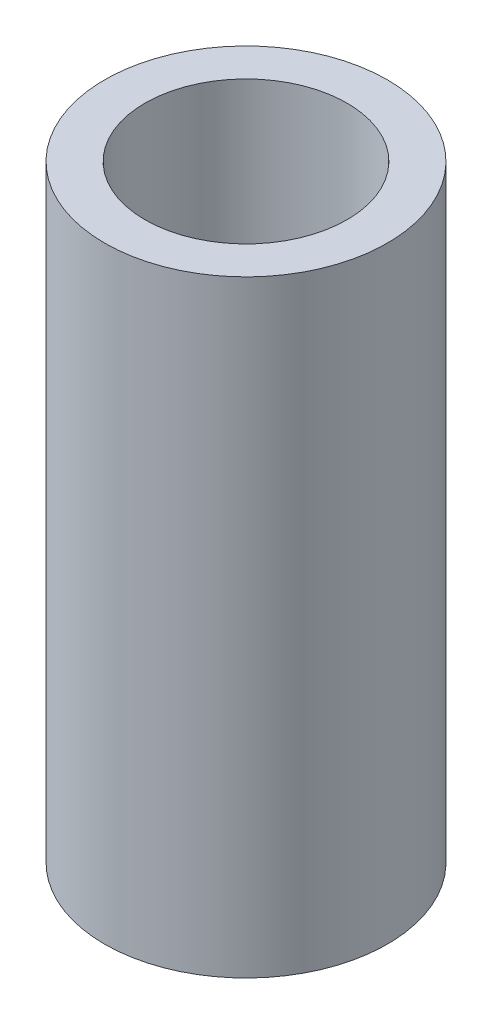
ISO-10303-21;
HEADER;
FILE_DESCRIPTION(('STEP AP214'),'2;1');
FILE_NAME('part.step','',(''),(''),'','','');
FILE_SCHEMA(('AUTOMOTIVE_DESIGN { 1 0 10303 214 1 1 1 1 }'));
ENDSEC;
DATA;
#1=APPLICATION_CONTEXT('core data for automotive mechanical design processes');
#2=APPLICATION_PROTOCOL_DEFINITION('international standard','automotive_design',2000,#1);
#3=PRODUCT_CONTEXT('',#1,'mechanical');
#4=PRODUCT('Part','Part','',(#3));
#5=PRODUCT_RELATED_PRODUCT_CATEGORY('part','',(#4));
#6=PRODUCT_DEFINITION_FORMATION('','',#4);
#7=PRODUCT_DEFINITION_CONTEXT('part definition',#1,'design');
#8=PRODUCT_DEFINITION('design','',#6,#7);
#9=PRODUCT_DEFINITION_SHAPE('','',#8);
#10=(LENGTH_UNIT() NAMED_UNIT(*) SI_UNIT(.MILLI.,.METRE.));
#11=(NAMED_UNIT(*) PLANE_ANGLE_UNIT() SI_UNIT($,.RADIAN.));
#12=(NAMED_UNIT(*) SI_UNIT($,.STERADIAN.) SOLID_ANGLE_UNIT());
#13=UNCERTAINTY_MEASURE_WITH_UNIT(LENGTH_MEASURE(1.E-05),#10,'distance_accuracy_value','');
#14=(GEOMETRIC_REPRESENTATION_CONTEXT(3) GLOBAL_UNCERTAINTY_ASSIGNED_CONTEXT((#13)) GLOBAL_UNIT_ASSIGNED_CONTEXT((#10,
#11,#12)) REPRESENTATION_CONTEXT('',''));
#15=CARTESIAN_POINT('',(0.,0.,0.));
#16=DIRECTION('',(0.,0.,1.));
#17=DIRECTION('',(1.,0.,0.));
#18=AXIS2_PLACEMENT_3D('',#15,#16,#17);
#19=CARTESIAN_POINT('',(0.,75.139010184047,0.));
#20=DIRECTION('',(0.,-1.,0.));
#21=DIRECTION('',(0.,0.,-1.));
#22=AXIS2_PLACEMENT_3D('',#19,#20,#21);
#23=CYLINDRICAL_SURFACE('',#22,17.5);
#24=CARTESIAN_POINT('',(0.,75.139010184047,0.));
#25=DIRECTION('',(0.,1.,0.));
#26=DIRECTION('',(0.,0.,1.));
#27=AXIS2_PLACEMENT_3D('',#24,#25,#26);
#28=CIRCLE('',#27,17.5);
#29=CARTESIAN_POINT('',(0.,75.139010184047,17.5));
#30=VERTEX_POINT('',#29);
#31=EDGE_CURVE('E10',#30,#30,#28,.T.);
#32=ORIENTED_EDGE('',*,*,#31,.F.);
#33=EDGE_LOOP('',(#32));
#34=FACE_BOUND('',#33,.T.);
#35=CARTESIAN_POINT('',(0.,0.,0.));
#36=DIRECTION('',(0.,1.,0.));
#37=DIRECTION('',(0.,0.,1.));
#38=AXIS2_PLACEMENT_3D('',#35,#36,#37);
#39=CIRCLE('',#38,17.5);
#40=CARTESIAN_POINT('',(0.,0.,17.5));
#41=VERTEX_POINT('',#40);
#42=EDGE_CURVE('E37',#41,#41,#39,.T.);
#43=ORIENTED_EDGE('',*,*,#42,.T.);
#44=EDGE_LOOP('',(#43));
#45=FACE_BOUND('',#44,.T.);
#46=ADVANCED_FACE('F40',(#34,#45),#23,.T.);
#47=CARTESIAN_POINT('',(0.,75.139010184047,0.));
#48=DIRECTION('',(0.,1.,0.));
#49=DIRECTION('',(0.,0.,1.));
#50=AXIS2_PLACEMENT_3D('',#47,#48,#49);
#51=PLANE('',#50);
#52=CARTESIAN_POINT('',(0.,75.139010184047,0.));
#53=DIRECTION('',(0.,1.,0.));
#54=DIRECTION('',(0.,0.,1.));
#55=AXIS2_PLACEMENT_3D('',#52,#53,#54);
#56=CIRCLE('',#55,12.50603852539);
#57=CARTESIAN_POINT('',(0.,75.139010184047,12.50603852539));
#58=VERTEX_POINT('',#57);
#59=EDGE_CURVE('E50',#58,#58,#56,.T.);
#60=ORIENTED_EDGE('',*,*,#59,.F.);
#61=EDGE_LOOP('',(#60));
#62=FACE_BOUND('',#61,.T.);
#63=ORIENTED_EDGE('',*,*,#31,.T.);
#64=EDGE_LOOP('',(#63));
#65=FACE_BOUND('',#64,.T.);
#66=ADVANCED_FACE('F59',(#62,#65),#51,.T.);
#67=CARTESIAN_POINT('',(0.,0.,0.));
#68=DIRECTION('',(0.,1.,0.));
#69=DIRECTION('',(0.,0.,1.));
#70=AXIS2_PLACEMENT_3D('',#67,#68,#69);
#71=PLANE('',#70);
#72=CARTESIAN_POINT('',(0.,0.,0.));
#73=DIRECTION('',(0.,1.,0.));
#74=DIRECTION('',(0.,0.,1.));
#75=AXIS2_PLACEMENT_3D('',#72,#73,#74);
#76=CIRCLE('',#75,12.50603852539);
#77=CARTESIAN_POINT('',(0.,0.,12.50603852539));
#78=VERTEX_POINT('',#77);
#79=EDGE_CURVE('E47',#78,#78,#76,.T.);
#80=ORIENTED_EDGE('',*,*,#79,.T.);
#81=EDGE_LOOP('',(#80));
#82=FACE_BOUND('',#81,.T.);
#83=ORIENTED_EDGE('',*,*,#42,.F.);
#84=EDGE_LOOP('',(#83));
#85=FACE_BOUND('',#84,.T.);
#86=ADVANCED_FACE('F58',(#82,#85),#71,.F.);
#87=CARTESIAN_POINT('',(0.,75.139010184047,0.));
#88=DIRECTION('',(0.,-1.,0.));
#89=DIRECTION('',(0.,0.,-1.));
#90=AXIS2_PLACEMENT_3D('',#87,#88,#89);
#91=CYLINDRICAL_SURFACE('',#90,12.50603852539);
#92=ORIENTED_EDGE('',*,*,#59,.T.);
#93=EDGE_LOOP('',(#92));
#94=FACE_BOUND('',#93,.T.);
#95=ORIENTED_EDGE('',*,*,#79,.F.);
#96=EDGE_LOOP('',(#95));
#97=FACE_BOUND('',#96,.T.);
#98=ADVANCED_FACE('F54',(#94,#97),#91,.F.);
#99=CLOSED_SHELL('',(#46,#66,#86,#98));
#100=MANIFOLD_SOLID_BREP('B2',#99);
#101=ADVANCED_BREP_SHAPE_REPRESENTATION('',(#18,#100),#14);
#102=SHAPE_DEFINITION_REPRESENTATION(#9,#101);
ENDSEC;
END-ISO-10303-21;
